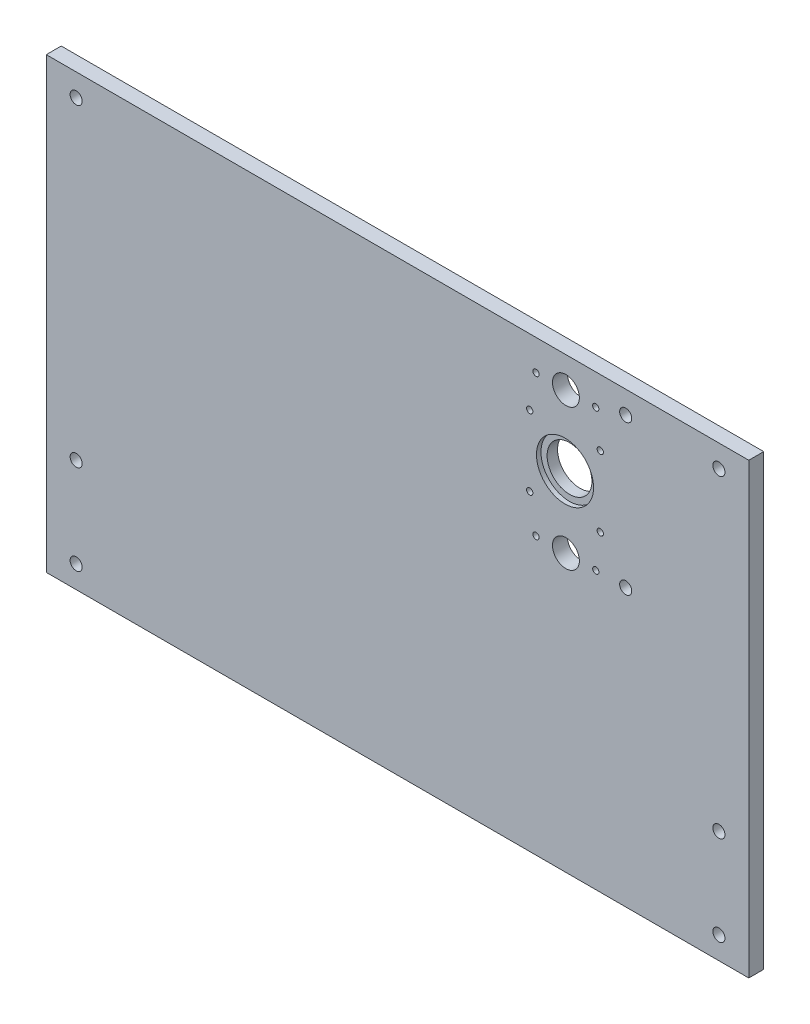
ISO-10303-21;
HEADER;
FILE_DESCRIPTION(('STEP AP214'),'2;1');
FILE_NAME('part.step','',(''),(''),'','','');
FILE_SCHEMA(('AUTOMOTIVE_DESIGN { 1 0 10303 214 1 1 1 1 }'));
ENDSEC;
DATA;
#1=APPLICATION_CONTEXT('core data for automotive mechanical design processes');
#2=APPLICATION_PROTOCOL_DEFINITION('international standard','automotive_design',2000,#1);
#3=PRODUCT_CONTEXT('',#1,'mechanical');
#4=PRODUCT('Part','Part','',(#3));
#5=PRODUCT_RELATED_PRODUCT_CATEGORY('part','',(#4));
#6=PRODUCT_DEFINITION_FORMATION('','',#4);
#7=PRODUCT_DEFINITION_CONTEXT('part definition',#1,'design');
#8=PRODUCT_DEFINITION('design','',#6,#7);
#9=PRODUCT_DEFINITION_SHAPE('','',#8);
#10=(LENGTH_UNIT() NAMED_UNIT(*) SI_UNIT(.MILLI.,.METRE.));
#11=(NAMED_UNIT(*) PLANE_ANGLE_UNIT() SI_UNIT($,.RADIAN.));
#12=(NAMED_UNIT(*) SI_UNIT($,.STERADIAN.) SOLID_ANGLE_UNIT());
#13=UNCERTAINTY_MEASURE_WITH_UNIT(LENGTH_MEASURE(1.E-05),#10,'distance_accuracy_value','');
#14=(GEOMETRIC_REPRESENTATION_CONTEXT(3) GLOBAL_UNCERTAINTY_ASSIGNED_CONTEXT((#13)) GLOBAL_UNIT_ASSIGNED_CONTEXT((#10,
#11,#12)) REPRESENTATION_CONTEXT('',''));
#15=CARTESIAN_POINT('',(0.,0.,0.));
#16=DIRECTION('',(0.,0.,1.));
#17=DIRECTION('',(1.,0.,0.));
#18=AXIS2_PLACEMENT_3D('',#15,#16,#17);
#19=CARTESIAN_POINT('',(235.,-150.,5.));
#20=DIRECTION('',(-1.,0.,0.));
#21=DIRECTION('',(0.,0.,1.));
#22=AXIS2_PLACEMENT_3D('',#19,#20,#21);
#23=PLANE('',#22);
#24=DIRECTION('',(0.,1.,0.));
#25=VECTOR('',#24,1.);
#26=CARTESIAN_POINT('',(235.,-150.,-5.));
#27=LINE('',#26,#25);
#28=CARTESIAN_POINT('',(235.,-150.,-5.));
#29=VERTEX_POINT('',#28);
#30=CARTESIAN_POINT('',(235.,150.,-5.));
#31=VERTEX_POINT('',#30);
#32=EDGE_CURVE('E100',#29,#31,#27,.T.);
#33=ORIENTED_EDGE('',*,*,#32,.T.);
#34=DIRECTION('',(0.,0.,-1.));
#35=VECTOR('',#34,1.);
#36=CARTESIAN_POINT('',(235.,150.,5.));
#37=LINE('',#36,#35);
#38=CARTESIAN_POINT('',(235.,150.,5.));
#39=VERTEX_POINT('',#38);
#40=EDGE_CURVE('E11',#39,#31,#37,.T.);
#41=ORIENTED_EDGE('',*,*,#40,.F.);
#42=DIRECTION('',(0.,1.,0.));
#43=VECTOR('',#42,1.);
#44=CARTESIAN_POINT('',(235.,-150.,5.));
#45=LINE('',#44,#43);
#46=CARTESIAN_POINT('',(235.,-150.,5.));
#47=VERTEX_POINT('',#46);
#48=EDGE_CURVE('E88',#47,#39,#45,.T.);
#49=ORIENTED_EDGE('',*,*,#48,.F.);
#50=DIRECTION('',(0.,0.,-1.));
#51=VECTOR('',#50,1.);
#52=CARTESIAN_POINT('',(235.,-150.,5.));
#53=LINE('',#52,#51);
#54=EDGE_CURVE('E96',#47,#29,#53,.T.);
#55=ORIENTED_EDGE('',*,*,#54,.T.);
#56=EDGE_LOOP('',(#33,#41,#49,#55));
#57=FACE_BOUND('',#56,.T.);
#58=ADVANCED_FACE('F37',(#57),#23,.F.);
#59=CARTESIAN_POINT('',(-235.,150.,5.));
#60=DIRECTION('',(0.,-1.,0.));
#61=DIRECTION('',(0.,0.,-1.));
#62=AXIS2_PLACEMENT_3D('',#59,#60,#61);
#63=PLANE('',#62);
#64=DIRECTION('',(-1.,0.,0.));
#65=VECTOR('',#64,1.);
#66=CARTESIAN_POINT('',(-235.,150.,-5.));
#67=LINE('',#66,#65);
#68=CARTESIAN_POINT('',(-235.,150.,-5.));
#69=VERTEX_POINT('',#68);
#70=EDGE_CURVE('E92',#31,#69,#67,.T.);
#71=ORIENTED_EDGE('',*,*,#70,.T.);
#72=DIRECTION('',(0.,0.,-1.));
#73=VECTOR('',#72,1.);
#74=CARTESIAN_POINT('',(-235.,150.,5.));
#75=LINE('',#74,#73);
#76=CARTESIAN_POINT('',(-235.,150.,5.));
#77=VERTEX_POINT('',#76);
#78=EDGE_CURVE('E45',#77,#69,#75,.T.);
#79=ORIENTED_EDGE('',*,*,#78,.F.);
#80=DIRECTION('',(-1.,0.,0.));
#81=VECTOR('',#80,1.);
#82=CARTESIAN_POINT('',(-235.,150.,5.));
#83=LINE('',#82,#81);
#84=EDGE_CURVE('E83',#39,#77,#83,.T.);
#85=ORIENTED_EDGE('',*,*,#84,.F.);
#86=ORIENTED_EDGE('',*,*,#40,.T.);
#87=EDGE_LOOP('',(#71,#79,#85,#86));
#88=FACE_BOUND('',#87,.T.);
#89=ADVANCED_FACE('F91',(#88),#63,.F.);
#90=CARTESIAN_POINT('',(-235.,-150.,5.));
#91=DIRECTION('',(1.,0.,0.));
#92=DIRECTION('',(0.,0.,-1.));
#93=AXIS2_PLACEMENT_3D('',#90,#91,#92);
#94=PLANE('',#93);
#95=DIRECTION('',(0.,-1.,0.));
#96=VECTOR('',#95,1.);
#97=CARTESIAN_POINT('',(-235.,-150.,-5.));
#98=LINE('',#97,#96);
#99=CARTESIAN_POINT('',(-235.,-150.,-5.));
#100=VERTEX_POINT('',#99);
#101=EDGE_CURVE('E70',#69,#100,#98,.T.);
#102=ORIENTED_EDGE('',*,*,#101,.T.);
#103=DIRECTION('',(0.,0.,-1.));
#104=VECTOR('',#103,1.);
#105=CARTESIAN_POINT('',(-235.,-150.,5.));
#106=LINE('',#105,#104);
#107=CARTESIAN_POINT('',(-235.,-150.,5.));
#108=VERTEX_POINT('',#107);
#109=EDGE_CURVE('E93',#108,#100,#106,.T.);
#110=ORIENTED_EDGE('',*,*,#109,.F.);
#111=DIRECTION('',(0.,-1.,0.));
#112=VECTOR('',#111,1.);
#113=CARTESIAN_POINT('',(-235.,-150.,5.));
#114=LINE('',#113,#112);
#115=EDGE_CURVE('E86',#77,#108,#114,.T.);
#116=ORIENTED_EDGE('',*,*,#115,.F.);
#117=ORIENTED_EDGE('',*,*,#78,.T.);
#118=EDGE_LOOP('',(#102,#110,#116,#117));
#119=FACE_BOUND('',#118,.T.);
#120=ADVANCED_FACE('F94',(#119),#94,.F.);
#121=CARTESIAN_POINT('',(-235.,-150.,5.));
#122=DIRECTION('',(0.,1.,0.));
#123=DIRECTION('',(0.,0.,1.));
#124=AXIS2_PLACEMENT_3D('',#121,#122,#123);
#125=PLANE('',#124);
#126=DIRECTION('',(1.,0.,0.));
#127=VECTOR('',#126,1.);
#128=CARTESIAN_POINT('',(-235.,-150.,-5.));
#129=LINE('',#128,#127);
#130=EDGE_CURVE('E76',#100,#29,#129,.T.);
#131=ORIENTED_EDGE('',*,*,#130,.T.);
#132=ORIENTED_EDGE('',*,*,#54,.F.);
#133=DIRECTION('',(1.,0.,0.));
#134=VECTOR('',#133,1.);
#135=CARTESIAN_POINT('',(-235.,-150.,5.));
#136=LINE('',#135,#134);
#137=EDGE_CURVE('E53',#108,#47,#136,.T.);
#138=ORIENTED_EDGE('',*,*,#137,.F.);
#139=ORIENTED_EDGE('',*,*,#109,.T.);
#140=EDGE_LOOP('',(#131,#132,#138,#139));
#141=FACE_BOUND('',#140,.T.);
#142=ADVANCED_FACE('F108',(#141),#125,.F.);
#143=CARTESIAN_POINT('',(0.,0.,5.));
#144=DIRECTION('',(0.,0.,-1.));
#145=DIRECTION('',(-1.,0.,0.));
#146=AXIS2_PLACEMENT_3D('',#143,#144,#145);
#147=PLANE('',#146);
#148=CARTESIAN_POINT('',(88.4499999999999,58.65,5.));
#149=DIRECTION('',(0.,0.,1.));
#150=DIRECTION('',(1.,0.,0.));
#151=AXIS2_PLACEMENT_3D('',#148,#149,#150);
#152=CIRCLE('',#151,2.1);
#153=CARTESIAN_POINT('',(90.5499999999999,58.65,5.));
#154=VERTEX_POINT('',#153);
#155=EDGE_CURVE('E228',#154,#154,#152,.T.);
#156=ORIENTED_EDGE('',*,*,#155,.F.);
#157=EDGE_LOOP('',(#156));
#158=FACE_BOUND('',#157,.T.);
#159=CARTESIAN_POINT('',(135.65,58.65,5.));
#160=DIRECTION('',(0.,0.,1.));
#161=DIRECTION('',(1.,0.,0.));
#162=AXIS2_PLACEMENT_3D('',#159,#160,#161);
#163=CIRCLE('',#162,2.09999999999999);
#164=CARTESIAN_POINT('',(137.75,58.65,5.));
#165=VERTEX_POINT('',#164);
#166=EDGE_CURVE('E222',#165,#165,#163,.T.);
#167=ORIENTED_EDGE('',*,*,#166,.F.);
#168=EDGE_LOOP('',(#167));
#169=FACE_BOUND('',#168,.T.);
#170=CARTESIAN_POINT('',(135.65,105.85,5.));
#171=DIRECTION('',(0.,0.,1.));
#172=DIRECTION('',(1.,0.,0.));
#173=AXIS2_PLACEMENT_3D('',#170,#171,#172);
#174=CIRCLE('',#173,2.09999999999999);
#175=CARTESIAN_POINT('',(137.75,105.85,5.));
#176=VERTEX_POINT('',#175);
#177=EDGE_CURVE('E216',#176,#176,#174,.T.);
#178=ORIENTED_EDGE('',*,*,#177,.F.);
#179=EDGE_LOOP('',(#178));
#180=FACE_BOUND('',#179,.T.);
#181=CARTESIAN_POINT('',(88.4499999999999,105.85,5.));
#182=DIRECTION('',(0.,0.,1.));
#183=DIRECTION('',(1.,0.,0.));
#184=AXIS2_PLACEMENT_3D('',#181,#182,#183);
#185=CIRCLE('',#184,2.1);
#186=CARTESIAN_POINT('',(90.5499999999999,105.85,5.));
#187=VERTEX_POINT('',#186);
#188=EDGE_CURVE('E210',#187,#187,#185,.T.);
#189=ORIENTED_EDGE('',*,*,#188,.F.);
#190=EDGE_LOOP('',(#189));
#191=FACE_BOUND('',#190,.T.);
#192=CARTESIAN_POINT('',(112.05,82.25,5.));
#193=DIRECTION('',(0.,0.,1.));
#194=DIRECTION('',(1.,0.,0.));
#195=AXIS2_PLACEMENT_3D('',#192,#193,#194);
#196=CIRCLE('',#195,19.1);
#197=CARTESIAN_POINT('',(131.15,82.25,5.));
#198=VERTEX_POINT('',#197);
#199=EDGE_CURVE('E198',#198,#198,#196,.T.);
#200=ORIENTED_EDGE('',*,*,#199,.F.);
#201=EDGE_LOOP('',(#200));
#202=FACE_BOUND('',#201,.T.);
#203=CARTESIAN_POINT('',(152.65,35.,5.));
#204=DIRECTION('',(0.,0.,1.));
#205=DIRECTION('',(1.,0.,0.));
#206=AXIS2_PLACEMENT_3D('',#203,#204,#205);
#207=CIRCLE('',#206,4.04999999999999);
#208=CARTESIAN_POINT('',(156.7,35.,5.));
#209=VERTEX_POINT('',#208);
#210=EDGE_CURVE('E192',#209,#209,#207,.T.);
#211=ORIENTED_EDGE('',*,*,#210,.F.);
#212=EDGE_LOOP('',(#211));
#213=FACE_BOUND('',#212,.T.);
#214=CARTESIAN_POINT('',(152.65,135.,5.));
#215=DIRECTION('',(0.,0.,1.));
#216=DIRECTION('',(1.,0.,0.));
#217=AXIS2_PLACEMENT_3D('',#214,#215,#216);
#218=CIRCLE('',#217,4.04999999999999);
#219=CARTESIAN_POINT('',(156.7,135.,5.));
#220=VERTEX_POINT('',#219);
#221=EDGE_CURVE('E186',#220,#220,#218,.T.);
#222=ORIENTED_EDGE('',*,*,#221,.F.);
#223=EDGE_LOOP('',(#222));
#224=FACE_BOUND('',#223,.T.);
#225=CARTESIAN_POINT('',(92.6499999999999,35.,5.));
#226=DIRECTION('',(0.,0.,1.));
#227=DIRECTION('',(1.,0.,0.));
#228=AXIS2_PLACEMENT_3D('',#225,#226,#227);
#229=CIRCLE('',#228,2.1);
#230=CARTESIAN_POINT('',(94.7499999999999,35.,5.));
#231=VERTEX_POINT('',#230);
#232=EDGE_CURVE('E180',#231,#231,#229,.T.);
#233=ORIENTED_EDGE('',*,*,#232,.F.);
#234=EDGE_LOOP('',(#233));
#235=FACE_BOUND('',#234,.T.);
#236=CARTESIAN_POINT('',(132.65,35.,5.));
#237=DIRECTION('',(0.,0.,1.));
#238=DIRECTION('',(1.,0.,0.));
#239=AXIS2_PLACEMENT_3D('',#236,#237,#238);
#240=CIRCLE('',#239,2.09999999999999);
#241=CARTESIAN_POINT('',(134.75,35.,5.));
#242=VERTEX_POINT('',#241);
#243=EDGE_CURVE('E174',#242,#242,#240,.T.);
#244=ORIENTED_EDGE('',*,*,#243,.F.);
#245=EDGE_LOOP('',(#244));
#246=FACE_BOUND('',#245,.T.);
#247=CARTESIAN_POINT('',(132.65,129.5,5.));
#248=DIRECTION('',(0.,0.,1.));
#249=DIRECTION('',(1.,0.,0.));
#250=AXIS2_PLACEMENT_3D('',#247,#248,#249);
#251=CIRCLE('',#250,2.09999999999999);
#252=CARTESIAN_POINT('',(134.75,129.5,5.));
#253=VERTEX_POINT('',#252);
#254=EDGE_CURVE('E168',#253,#253,#251,.T.);
#255=ORIENTED_EDGE('',*,*,#254,.F.);
#256=EDGE_LOOP('',(#255));
#257=FACE_BOUND('',#256,.T.);
#258=CARTESIAN_POINT('',(92.6499999999999,129.5,5.));
#259=DIRECTION('',(0.,0.,1.));
#260=DIRECTION('',(1.,0.,0.));
#261=AXIS2_PLACEMENT_3D('',#258,#259,#260);
#262=CIRCLE('',#261,2.1);
#263=CARTESIAN_POINT('',(94.7499999999999,129.5,5.));
#264=VERTEX_POINT('',#263);
#265=EDGE_CURVE('E162',#264,#264,#262,.T.);
#266=ORIENTED_EDGE('',*,*,#265,.F.);
#267=EDGE_LOOP('',(#266));
#268=FACE_BOUND('',#267,.T.);
#269=CARTESIAN_POINT('',(112.65,35.,5.));
#270=DIRECTION('',(0.,0.,1.));
#271=DIRECTION('',(1.,0.,0.));
#272=AXIS2_PLACEMENT_3D('',#269,#270,#271);
#273=CIRCLE('',#272,9.);
#274=CARTESIAN_POINT('',(121.65,35.,5.));
#275=VERTEX_POINT('',#274);
#276=EDGE_CURVE('E156',#275,#275,#273,.T.);
#277=ORIENTED_EDGE('',*,*,#276,.F.);
#278=EDGE_LOOP('',(#277));
#279=FACE_BOUND('',#278,.T.);
#280=CARTESIAN_POINT('',(112.65,129.5,5.));
#281=DIRECTION('',(0.,0.,1.));
#282=DIRECTION('',(1.,0.,0.));
#283=AXIS2_PLACEMENT_3D('',#280,#281,#282);
#284=CIRCLE('',#283,9.);
#285=CARTESIAN_POINT('',(121.65,129.5,5.));
#286=VERTEX_POINT('',#285);
#287=EDGE_CURVE('E150',#286,#286,#284,.T.);
#288=ORIENTED_EDGE('',*,*,#287,.F.);
#289=EDGE_LOOP('',(#288));
#290=FACE_BOUND('',#289,.T.);
#291=CARTESIAN_POINT('',(215.000000000002,134.999999999995,5.));
#292=DIRECTION('',(0.,0.,1.));
#293=DIRECTION('',(1.,0.,0.));
#294=AXIS2_PLACEMENT_3D('',#291,#292,#293);
#295=CIRCLE('',#294,4.04999999999999);
#296=CARTESIAN_POINT('',(219.050000000002,134.999999999995,5.));
#297=VERTEX_POINT('',#296);
#298=EDGE_CURVE('E144',#297,#297,#295,.T.);
#299=ORIENTED_EDGE('',*,*,#298,.F.);
#300=EDGE_LOOP('',(#299));
#301=FACE_BOUND('',#300,.T.);
#302=CARTESIAN_POINT('',(-215.,135.,5.));
#303=DIRECTION('',(0.,0.,1.));
#304=DIRECTION('',(1.,0.,0.));
#305=AXIS2_PLACEMENT_3D('',#302,#303,#304);
#306=CIRCLE('',#305,4.04999999999999);
#307=CARTESIAN_POINT('',(-210.95,135.,5.));
#308=VERTEX_POINT('',#307);
#309=EDGE_CURVE('E138',#308,#308,#306,.T.);
#310=ORIENTED_EDGE('',*,*,#309,.F.);
#311=EDGE_LOOP('',(#310));
#312=FACE_BOUND('',#311,.T.);
#313=CARTESIAN_POINT('',(215.000000000002,-134.999999999995,5.));
#314=DIRECTION('',(0.,0.,1.));
#315=DIRECTION('',(1.,0.,0.));
#316=AXIS2_PLACEMENT_3D('',#313,#314,#315);
#317=CIRCLE('',#316,4.04999999999999);
#318=CARTESIAN_POINT('',(219.050000000002,-134.999999999995,5.));
#319=VERTEX_POINT('',#318);
#320=EDGE_CURVE('E132',#319,#319,#317,.T.);
#321=ORIENTED_EDGE('',*,*,#320,.F.);
#322=EDGE_LOOP('',(#321));
#323=FACE_BOUND('',#322,.T.);
#324=CARTESIAN_POINT('',(215.000000000002,-74.9999999999943,5.));
#325=DIRECTION('',(0.,0.,1.));
#326=DIRECTION('',(1.,0.,0.));
#327=AXIS2_PLACEMENT_3D('',#324,#325,#326);
#328=CIRCLE('',#327,4.04999999999999);
#329=CARTESIAN_POINT('',(219.050000000002,-74.9999999999943,5.));
#330=VERTEX_POINT('',#329);
#331=EDGE_CURVE('E126',#330,#330,#328,.T.);
#332=ORIENTED_EDGE('',*,*,#331,.F.);
#333=EDGE_LOOP('',(#332));
#334=FACE_BOUND('',#333,.T.);
#335=CARTESIAN_POINT('',(-215.000000000002,-134.999999999995,5.));
#336=DIRECTION('',(0.,0.,1.));
#337=DIRECTION('',(1.,0.,0.));
#338=AXIS2_PLACEMENT_3D('',#335,#336,#337);
#339=CIRCLE('',#338,4.04999999999999);
#340=CARTESIAN_POINT('',(-210.950000000002,-134.999999999995,5.));
#341=VERTEX_POINT('',#340);
#342=EDGE_CURVE('E120',#341,#341,#339,.T.);
#343=ORIENTED_EDGE('',*,*,#342,.F.);
#344=EDGE_LOOP('',(#343));
#345=FACE_BOUND('',#344,.T.);
#346=CARTESIAN_POINT('',(-215.000000000002,-74.9999999999943,5.));
#347=DIRECTION('',(0.,0.,1.));
#348=DIRECTION('',(1.,0.,0.));
#349=AXIS2_PLACEMENT_3D('',#346,#347,#348);
#350=CIRCLE('',#349,4.04999999999999);
#351=CARTESIAN_POINT('',(-210.950000000002,-74.9999999999943,5.));
#352=VERTEX_POINT('',#351);
#353=EDGE_CURVE('E114',#352,#352,#350,.T.);
#354=ORIENTED_EDGE('',*,*,#353,.F.);
#355=EDGE_LOOP('',(#354));
#356=FACE_BOUND('',#355,.T.);
#357=ORIENTED_EDGE('',*,*,#48,.T.);
#358=ORIENTED_EDGE('',*,*,#84,.T.);
#359=ORIENTED_EDGE('',*,*,#115,.T.);
#360=ORIENTED_EDGE('',*,*,#137,.T.);
#361=EDGE_LOOP('',(#357,#358,#359,#360));
#362=FACE_BOUND('',#361,.T.);
#363=ADVANCED_FACE('F84',(#158,#169,#180,#191,#202,#213,#224,#235,#246,#257,#268,#279,#290,#301,
#312,#323,#334,#345,#356,#362),#147,.F.);
#364=CARTESIAN_POINT('',(0.,0.,-5.));
#365=DIRECTION('',(0.,0.,-1.));
#366=DIRECTION('',(-1.,0.,0.));
#367=AXIS2_PLACEMENT_3D('',#364,#365,#366);
#368=PLANE('',#367);
#369=CARTESIAN_POINT('',(88.4499999999999,58.65,-5.));
#370=DIRECTION('',(0.,0.,1.));
#371=DIRECTION('',(1.,0.,0.));
#372=AXIS2_PLACEMENT_3D('',#369,#370,#371);
#373=CIRCLE('',#372,2.1);
#374=CARTESIAN_POINT('',(90.5499999999999,58.65,-5.));
#375=VERTEX_POINT('',#374);
#376=EDGE_CURVE('E225',#375,#375,#373,.T.);
#377=ORIENTED_EDGE('',*,*,#376,.T.);
#378=EDGE_LOOP('',(#377));
#379=FACE_BOUND('',#378,.T.);
#380=CARTESIAN_POINT('',(135.65,58.65,-5.));
#381=DIRECTION('',(0.,0.,1.));
#382=DIRECTION('',(1.,0.,0.));
#383=AXIS2_PLACEMENT_3D('',#380,#381,#382);
#384=CIRCLE('',#383,2.09999999999999);
#385=CARTESIAN_POINT('',(137.75,58.65,-5.));
#386=VERTEX_POINT('',#385);
#387=EDGE_CURVE('E219',#386,#386,#384,.T.);
#388=ORIENTED_EDGE('',*,*,#387,.T.);
#389=EDGE_LOOP('',(#388));
#390=FACE_BOUND('',#389,.T.);
#391=CARTESIAN_POINT('',(135.65,105.85,-5.));
#392=DIRECTION('',(0.,0.,1.));
#393=DIRECTION('',(1.,0.,0.));
#394=AXIS2_PLACEMENT_3D('',#391,#392,#393);
#395=CIRCLE('',#394,2.09999999999999);
#396=CARTESIAN_POINT('',(137.75,105.85,-5.));
#397=VERTEX_POINT('',#396);
#398=EDGE_CURVE('E213',#397,#397,#395,.T.);
#399=ORIENTED_EDGE('',*,*,#398,.T.);
#400=EDGE_LOOP('',(#399));
#401=FACE_BOUND('',#400,.T.);
#402=CARTESIAN_POINT('',(88.4499999999999,105.85,-5.));
#403=DIRECTION('',(0.,0.,1.));
#404=DIRECTION('',(1.,0.,0.));
#405=AXIS2_PLACEMENT_3D('',#402,#403,#404);
#406=CIRCLE('',#405,2.1);
#407=CARTESIAN_POINT('',(90.5499999999999,105.85,-5.));
#408=VERTEX_POINT('',#407);
#409=EDGE_CURVE('E207',#408,#408,#406,.T.);
#410=ORIENTED_EDGE('',*,*,#409,.T.);
#411=EDGE_LOOP('',(#410));
#412=FACE_BOUND('',#411,.T.);
#413=CARTESIAN_POINT('',(112.05,82.25,-5.));
#414=DIRECTION('',(0.,0.,1.));
#415=DIRECTION('',(1.,0.,0.));
#416=AXIS2_PLACEMENT_3D('',#413,#414,#415);
#417=CIRCLE('',#416,15.);
#418=CARTESIAN_POINT('',(127.05,82.25,-5.));
#419=VERTEX_POINT('',#418);
#420=EDGE_CURVE('E201',#419,#419,#417,.T.);
#421=ORIENTED_EDGE('',*,*,#420,.T.);
#422=EDGE_LOOP('',(#421));
#423=FACE_BOUND('',#422,.T.);
#424=CARTESIAN_POINT('',(152.65,35.,-5.));
#425=DIRECTION('',(0.,0.,1.));
#426=DIRECTION('',(1.,0.,0.));
#427=AXIS2_PLACEMENT_3D('',#424,#425,#426);
#428=CIRCLE('',#427,4.04999999999999);
#429=CARTESIAN_POINT('',(156.7,35.,-5.));
#430=VERTEX_POINT('',#429);
#431=EDGE_CURVE('E189',#430,#430,#428,.T.);
#432=ORIENTED_EDGE('',*,*,#431,.T.);
#433=EDGE_LOOP('',(#432));
#434=FACE_BOUND('',#433,.T.);
#435=CARTESIAN_POINT('',(152.65,135.,-5.));
#436=DIRECTION('',(0.,0.,1.));
#437=DIRECTION('',(1.,0.,0.));
#438=AXIS2_PLACEMENT_3D('',#435,#436,#437);
#439=CIRCLE('',#438,4.04999999999999);
#440=CARTESIAN_POINT('',(156.7,135.,-5.));
#441=VERTEX_POINT('',#440);
#442=EDGE_CURVE('E183',#441,#441,#439,.T.);
#443=ORIENTED_EDGE('',*,*,#442,.T.);
#444=EDGE_LOOP('',(#443));
#445=FACE_BOUND('',#444,.T.);
#446=CARTESIAN_POINT('',(92.6499999999999,35.,-5.));
#447=DIRECTION('',(0.,0.,1.));
#448=DIRECTION('',(1.,0.,0.));
#449=AXIS2_PLACEMENT_3D('',#446,#447,#448);
#450=CIRCLE('',#449,2.1);
#451=CARTESIAN_POINT('',(94.7499999999999,35.,-5.));
#452=VERTEX_POINT('',#451);
#453=EDGE_CURVE('E177',#452,#452,#450,.T.);
#454=ORIENTED_EDGE('',*,*,#453,.T.);
#455=EDGE_LOOP('',(#454));
#456=FACE_BOUND('',#455,.T.);
#457=CARTESIAN_POINT('',(132.65,35.,-5.));
#458=DIRECTION('',(0.,0.,1.));
#459=DIRECTION('',(1.,0.,0.));
#460=AXIS2_PLACEMENT_3D('',#457,#458,#459);
#461=CIRCLE('',#460,2.09999999999999);
#462=CARTESIAN_POINT('',(134.75,35.,-5.));
#463=VERTEX_POINT('',#462);
#464=EDGE_CURVE('E171',#463,#463,#461,.T.);
#465=ORIENTED_EDGE('',*,*,#464,.T.);
#466=EDGE_LOOP('',(#465));
#467=FACE_BOUND('',#466,.T.);
#468=CARTESIAN_POINT('',(132.65,129.5,-5.));
#469=DIRECTION('',(0.,0.,1.));
#470=DIRECTION('',(1.,0.,0.));
#471=AXIS2_PLACEMENT_3D('',#468,#469,#470);
#472=CIRCLE('',#471,2.09999999999999);
#473=CARTESIAN_POINT('',(134.75,129.5,-5.));
#474=VERTEX_POINT('',#473);
#475=EDGE_CURVE('E165',#474,#474,#472,.T.);
#476=ORIENTED_EDGE('',*,*,#475,.T.);
#477=EDGE_LOOP('',(#476));
#478=FACE_BOUND('',#477,.T.);
#479=CARTESIAN_POINT('',(92.6499999999999,129.5,-5.));
#480=DIRECTION('',(0.,0.,1.));
#481=DIRECTION('',(1.,0.,0.));
#482=AXIS2_PLACEMENT_3D('',#479,#480,#481);
#483=CIRCLE('',#482,2.1);
#484=CARTESIAN_POINT('',(94.7499999999999,129.5,-5.));
#485=VERTEX_POINT('',#484);
#486=EDGE_CURVE('E159',#485,#485,#483,.T.);
#487=ORIENTED_EDGE('',*,*,#486,.T.);
#488=EDGE_LOOP('',(#487));
#489=FACE_BOUND('',#488,.T.);
#490=CARTESIAN_POINT('',(112.65,35.,-5.));
#491=DIRECTION('',(0.,0.,1.));
#492=DIRECTION('',(1.,0.,0.));
#493=AXIS2_PLACEMENT_3D('',#490,#491,#492);
#494=CIRCLE('',#493,9.);
#495=CARTESIAN_POINT('',(121.65,35.,-5.));
#496=VERTEX_POINT('',#495);
#497=EDGE_CURVE('E153',#496,#496,#494,.T.);
#498=ORIENTED_EDGE('',*,*,#497,.T.);
#499=EDGE_LOOP('',(#498));
#500=FACE_BOUND('',#499,.T.);
#501=CARTESIAN_POINT('',(112.65,129.5,-5.));
#502=DIRECTION('',(0.,0.,1.));
#503=DIRECTION('',(1.,0.,0.));
#504=AXIS2_PLACEMENT_3D('',#501,#502,#503);
#505=CIRCLE('',#504,9.);
#506=CARTESIAN_POINT('',(121.65,129.5,-5.));
#507=VERTEX_POINT('',#506);
#508=EDGE_CURVE('E147',#507,#507,#505,.T.);
#509=ORIENTED_EDGE('',*,*,#508,.T.);
#510=EDGE_LOOP('',(#509));
#511=FACE_BOUND('',#510,.T.);
#512=CARTESIAN_POINT('',(215.000000000002,134.999999999995,-5.));
#513=DIRECTION('',(0.,0.,1.));
#514=DIRECTION('',(1.,0.,0.));
#515=AXIS2_PLACEMENT_3D('',#512,#513,#514);
#516=CIRCLE('',#515,4.04999999999999);
#517=CARTESIAN_POINT('',(219.050000000002,134.999999999995,-5.));
#518=VERTEX_POINT('',#517);
#519=EDGE_CURVE('E141',#518,#518,#516,.T.);
#520=ORIENTED_EDGE('',*,*,#519,.T.);
#521=EDGE_LOOP('',(#520));
#522=FACE_BOUND('',#521,.T.);
#523=CARTESIAN_POINT('',(-215.,135.,-5.));
#524=DIRECTION('',(0.,0.,1.));
#525=DIRECTION('',(1.,0.,0.));
#526=AXIS2_PLACEMENT_3D('',#523,#524,#525);
#527=CIRCLE('',#526,4.04999999999999);
#528=CARTESIAN_POINT('',(-210.95,135.,-5.));
#529=VERTEX_POINT('',#528);
#530=EDGE_CURVE('E135',#529,#529,#527,.T.);
#531=ORIENTED_EDGE('',*,*,#530,.T.);
#532=EDGE_LOOP('',(#531));
#533=FACE_BOUND('',#532,.T.);
#534=CARTESIAN_POINT('',(215.000000000002,-134.999999999995,-5.));
#535=DIRECTION('',(0.,0.,1.));
#536=DIRECTION('',(1.,0.,0.));
#537=AXIS2_PLACEMENT_3D('',#534,#535,#536);
#538=CIRCLE('',#537,4.04999999999999);
#539=CARTESIAN_POINT('',(219.050000000002,-134.999999999995,-5.));
#540=VERTEX_POINT('',#539);
#541=EDGE_CURVE('E129',#540,#540,#538,.T.);
#542=ORIENTED_EDGE('',*,*,#541,.T.);
#543=EDGE_LOOP('',(#542));
#544=FACE_BOUND('',#543,.T.);
#545=CARTESIAN_POINT('',(215.000000000002,-74.9999999999943,-5.));
#546=DIRECTION('',(0.,0.,1.));
#547=DIRECTION('',(1.,0.,0.));
#548=AXIS2_PLACEMENT_3D('',#545,#546,#547);
#549=CIRCLE('',#548,4.04999999999999);
#550=CARTESIAN_POINT('',(219.050000000002,-74.9999999999943,-5.));
#551=VERTEX_POINT('',#550);
#552=EDGE_CURVE('E123',#551,#551,#549,.T.);
#553=ORIENTED_EDGE('',*,*,#552,.T.);
#554=EDGE_LOOP('',(#553));
#555=FACE_BOUND('',#554,.T.);
#556=CARTESIAN_POINT('',(-215.000000000002,-134.999999999995,-5.));
#557=DIRECTION('',(0.,0.,1.));
#558=DIRECTION('',(1.,0.,0.));
#559=AXIS2_PLACEMENT_3D('',#556,#557,#558);
#560=CIRCLE('',#559,4.04999999999999);
#561=CARTESIAN_POINT('',(-210.950000000002,-134.999999999995,-5.));
#562=VERTEX_POINT('',#561);
#563=EDGE_CURVE('E117',#562,#562,#560,.T.);
#564=ORIENTED_EDGE('',*,*,#563,.T.);
#565=EDGE_LOOP('',(#564));
#566=FACE_BOUND('',#565,.T.);
#567=CARTESIAN_POINT('',(-215.000000000002,-74.9999999999943,-5.));
#568=DIRECTION('',(0.,0.,1.));
#569=DIRECTION('',(1.,0.,0.));
#570=AXIS2_PLACEMENT_3D('',#567,#568,#569);
#571=CIRCLE('',#570,4.04999999999999);
#572=CARTESIAN_POINT('',(-210.950000000002,-74.9999999999943,-5.));
#573=VERTEX_POINT('',#572);
#574=EDGE_CURVE('E103',#573,#573,#571,.T.);
#575=ORIENTED_EDGE('',*,*,#574,.T.);
#576=EDGE_LOOP('',(#575));
#577=FACE_BOUND('',#576,.T.);
#578=ORIENTED_EDGE('',*,*,#32,.F.);
#579=ORIENTED_EDGE('',*,*,#130,.F.);
#580=ORIENTED_EDGE('',*,*,#101,.F.);
#581=ORIENTED_EDGE('',*,*,#70,.F.);
#582=EDGE_LOOP('',(#578,#579,#580,#581));
#583=FACE_BOUND('',#582,.T.);
#584=ADVANCED_FACE('F111',(#379,#390,#401,#412,#423,#434,#445,#456,#467,#478,#489,#500,#511,
#522,#533,#544,#555,#566,#577,#583),#368,.T.);
#585=CARTESIAN_POINT('',(-215.000000000002,-74.9999999999943,-5.));
#586=DIRECTION('',(0.,0.,1.));
#587=DIRECTION('',(1.,0.,0.));
#588=AXIS2_PLACEMENT_3D('',#585,#586,#587);
#589=CYLINDRICAL_SURFACE('',#588,4.04999999999999);
#590=ORIENTED_EDGE('',*,*,#574,.F.);
#591=EDGE_LOOP('',(#590));
#592=FACE_BOUND('',#591,.T.);
#593=ORIENTED_EDGE('',*,*,#353,.T.);
#594=EDGE_LOOP('',(#593));
#595=FACE_BOUND('',#594,.T.);
#596=ADVANCED_FACE('F282',(#592,#595),#589,.F.);
#597=CARTESIAN_POINT('',(-215.000000000002,-134.999999999995,-5.));
#598=DIRECTION('',(0.,0.,1.));
#599=DIRECTION('',(1.,0.,0.));
#600=AXIS2_PLACEMENT_3D('',#597,#598,#599);
#601=CYLINDRICAL_SURFACE('',#600,4.04999999999999);
#602=ORIENTED_EDGE('',*,*,#563,.F.);
#603=EDGE_LOOP('',(#602));
#604=FACE_BOUND('',#603,.T.);
#605=ORIENTED_EDGE('',*,*,#342,.T.);
#606=EDGE_LOOP('',(#605));
#607=FACE_BOUND('',#606,.T.);
#608=ADVANCED_FACE('F284',(#604,#607),#601,.F.);
#609=CARTESIAN_POINT('',(215.000000000002,-74.9999999999943,-5.));
#610=DIRECTION('',(0.,0.,1.));
#611=DIRECTION('',(1.,0.,0.));
#612=AXIS2_PLACEMENT_3D('',#609,#610,#611);
#613=CYLINDRICAL_SURFACE('',#612,4.04999999999999);
#614=ORIENTED_EDGE('',*,*,#552,.F.);
#615=EDGE_LOOP('',(#614));
#616=FACE_BOUND('',#615,.T.);
#617=ORIENTED_EDGE('',*,*,#331,.T.);
#618=EDGE_LOOP('',(#617));
#619=FACE_BOUND('',#618,.T.);
#620=ADVANCED_FACE('F291',(#616,#619),#613,.F.);
#621=CARTESIAN_POINT('',(215.000000000002,-134.999999999995,-5.));
#622=DIRECTION('',(0.,0.,1.));
#623=DIRECTION('',(1.,0.,0.));
#624=AXIS2_PLACEMENT_3D('',#621,#622,#623);
#625=CYLINDRICAL_SURFACE('',#624,4.04999999999999);
#626=ORIENTED_EDGE('',*,*,#541,.F.);
#627=EDGE_LOOP('',(#626));
#628=FACE_BOUND('',#627,.T.);
#629=ORIENTED_EDGE('',*,*,#320,.T.);
#630=EDGE_LOOP('',(#629));
#631=FACE_BOUND('',#630,.T.);
#632=ADVANCED_FACE('F415',(#628,#631),#625,.F.);
#633=CARTESIAN_POINT('',(-215.,135.,-5.));
#634=DIRECTION('',(0.,0.,1.));
#635=DIRECTION('',(1.,0.,0.));
#636=AXIS2_PLACEMENT_3D('',#633,#634,#635);
#637=CYLINDRICAL_SURFACE('',#636,4.04999999999999);
#638=ORIENTED_EDGE('',*,*,#530,.F.);
#639=EDGE_LOOP('',(#638));
#640=FACE_BOUND('',#639,.T.);
#641=ORIENTED_EDGE('',*,*,#309,.T.);
#642=EDGE_LOOP('',(#641));
#643=FACE_BOUND('',#642,.T.);
#644=ADVANCED_FACE('F411',(#640,#643),#637,.F.);
#645=CARTESIAN_POINT('',(215.000000000002,134.999999999995,-5.));
#646=DIRECTION('',(0.,0.,1.));
#647=DIRECTION('',(1.,0.,0.));
#648=AXIS2_PLACEMENT_3D('',#645,#646,#647);
#649=CYLINDRICAL_SURFACE('',#648,4.04999999999999);
#650=ORIENTED_EDGE('',*,*,#519,.F.);
#651=EDGE_LOOP('',(#650));
#652=FACE_BOUND('',#651,.T.);
#653=ORIENTED_EDGE('',*,*,#298,.T.);
#654=EDGE_LOOP('',(#653));
#655=FACE_BOUND('',#654,.T.);
#656=ADVANCED_FACE('F407',(#652,#655),#649,.F.);
#657=CARTESIAN_POINT('',(112.65,129.5,-5.));
#658=DIRECTION('',(0.,0.,1.));
#659=DIRECTION('',(1.,0.,0.));
#660=AXIS2_PLACEMENT_3D('',#657,#658,#659);
#661=CYLINDRICAL_SURFACE('',#660,9.);
#662=ORIENTED_EDGE('',*,*,#508,.F.);
#663=EDGE_LOOP('',(#662));
#664=FACE_BOUND('',#663,.T.);
#665=ORIENTED_EDGE('',*,*,#287,.T.);
#666=EDGE_LOOP('',(#665));
#667=FACE_BOUND('',#666,.T.);
#668=ADVANCED_FACE('F403',(#664,#667),#661,.F.);
#669=CARTESIAN_POINT('',(112.65,35.,-5.));
#670=DIRECTION('',(0.,0.,1.));
#671=DIRECTION('',(1.,0.,0.));
#672=AXIS2_PLACEMENT_3D('',#669,#670,#671);
#673=CYLINDRICAL_SURFACE('',#672,9.);
#674=ORIENTED_EDGE('',*,*,#497,.F.);
#675=EDGE_LOOP('',(#674));
#676=FACE_BOUND('',#675,.T.);
#677=ORIENTED_EDGE('',*,*,#276,.T.);
#678=EDGE_LOOP('',(#677));
#679=FACE_BOUND('',#678,.T.);
#680=ADVANCED_FACE('F399',(#676,#679),#673,.F.);
#681=CARTESIAN_POINT('',(92.6499999999999,129.5,-5.));
#682=DIRECTION('',(0.,0.,1.));
#683=DIRECTION('',(1.,0.,0.));
#684=AXIS2_PLACEMENT_3D('',#681,#682,#683);
#685=CYLINDRICAL_SURFACE('',#684,2.1);
#686=ORIENTED_EDGE('',*,*,#486,.F.);
#687=EDGE_LOOP('',(#686));
#688=FACE_BOUND('',#687,.T.);
#689=ORIENTED_EDGE('',*,*,#265,.T.);
#690=EDGE_LOOP('',(#689));
#691=FACE_BOUND('',#690,.T.);
#692=ADVANCED_FACE('F395',(#688,#691),#685,.F.);
#693=CARTESIAN_POINT('',(132.65,129.5,-5.));
#694=DIRECTION('',(0.,0.,1.));
#695=DIRECTION('',(1.,0.,0.));
#696=AXIS2_PLACEMENT_3D('',#693,#694,#695);
#697=CYLINDRICAL_SURFACE('',#696,2.09999999999999);
#698=ORIENTED_EDGE('',*,*,#475,.F.);
#699=EDGE_LOOP('',(#698));
#700=FACE_BOUND('',#699,.T.);
#701=ORIENTED_EDGE('',*,*,#254,.T.);
#702=EDGE_LOOP('',(#701));
#703=FACE_BOUND('',#702,.T.);
#704=ADVANCED_FACE('F391',(#700,#703),#697,.F.);
#705=CARTESIAN_POINT('',(132.65,35.,-5.));
#706=DIRECTION('',(0.,0.,1.));
#707=DIRECTION('',(1.,0.,0.));
#708=AXIS2_PLACEMENT_3D('',#705,#706,#707);
#709=CYLINDRICAL_SURFACE('',#708,2.09999999999999);
#710=ORIENTED_EDGE('',*,*,#464,.F.);
#711=EDGE_LOOP('',(#710));
#712=FACE_BOUND('',#711,.T.);
#713=ORIENTED_EDGE('',*,*,#243,.T.);
#714=EDGE_LOOP('',(#713));
#715=FACE_BOUND('',#714,.T.);
#716=ADVANCED_FACE('F387',(#712,#715),#709,.F.);
#717=CARTESIAN_POINT('',(92.6499999999999,35.,-5.));
#718=DIRECTION('',(0.,0.,1.));
#719=DIRECTION('',(1.,0.,0.));
#720=AXIS2_PLACEMENT_3D('',#717,#718,#719);
#721=CYLINDRICAL_SURFACE('',#720,2.1);
#722=ORIENTED_EDGE('',*,*,#453,.F.);
#723=EDGE_LOOP('',(#722));
#724=FACE_BOUND('',#723,.T.);
#725=ORIENTED_EDGE('',*,*,#232,.T.);
#726=EDGE_LOOP('',(#725));
#727=FACE_BOUND('',#726,.T.);
#728=ADVANCED_FACE('F383',(#724,#727),#721,.F.);
#729=CARTESIAN_POINT('',(152.65,135.,-5.));
#730=DIRECTION('',(0.,0.,1.));
#731=DIRECTION('',(1.,0.,0.));
#732=AXIS2_PLACEMENT_3D('',#729,#730,#731);
#733=CYLINDRICAL_SURFACE('',#732,4.04999999999999);
#734=ORIENTED_EDGE('',*,*,#442,.F.);
#735=EDGE_LOOP('',(#734));
#736=FACE_BOUND('',#735,.T.);
#737=ORIENTED_EDGE('',*,*,#221,.T.);
#738=EDGE_LOOP('',(#737));
#739=FACE_BOUND('',#738,.T.);
#740=ADVANCED_FACE('F379',(#736,#739),#733,.F.);
#741=CARTESIAN_POINT('',(152.65,35.,-5.));
#742=DIRECTION('',(0.,0.,1.));
#743=DIRECTION('',(1.,0.,0.));
#744=AXIS2_PLACEMENT_3D('',#741,#742,#743);
#745=CYLINDRICAL_SURFACE('',#744,4.04999999999999);
#746=ORIENTED_EDGE('',*,*,#431,.F.);
#747=EDGE_LOOP('',(#746));
#748=FACE_BOUND('',#747,.T.);
#749=ORIENTED_EDGE('',*,*,#210,.T.);
#750=EDGE_LOOP('',(#749));
#751=FACE_BOUND('',#750,.T.);
#752=ADVANCED_FACE('F375',(#748,#751),#745,.F.);
#753=CARTESIAN_POINT('',(112.05,82.25,2.));
#754=DIRECTION('',(0.,0.,1.));
#755=DIRECTION('',(1.,0.,0.));
#756=AXIS2_PLACEMENT_3D('',#753,#754,#755);
#757=CYLINDRICAL_SURFACE('',#756,19.1);
#758=CARTESIAN_POINT('',(112.05,82.25,2.));
#759=DIRECTION('',(0.,0.,1.));
#760=DIRECTION('',(1.,0.,0.));
#761=AXIS2_PLACEMENT_3D('',#758,#759,#760);
#762=CIRCLE('',#761,19.1);
#763=CARTESIAN_POINT('',(131.15,82.25,2.));
#764=VERTEX_POINT('',#763);
#765=EDGE_CURVE('E195',#764,#764,#762,.T.);
#766=ORIENTED_EDGE('',*,*,#765,.F.);
#767=EDGE_LOOP('',(#766));
#768=FACE_BOUND('',#767,.T.);
#769=ORIENTED_EDGE('',*,*,#199,.T.);
#770=EDGE_LOOP('',(#769));
#771=FACE_BOUND('',#770,.T.);
#772=ADVANCED_FACE('F371',(#768,#771),#757,.F.);
#773=CARTESIAN_POINT('',(112.05,82.25,2.));
#774=DIRECTION('',(0.,0.,1.));
#775=DIRECTION('',(1.,0.,0.));
#776=AXIS2_PLACEMENT_3D('',#773,#774,#775);
#777=PLANE('',#776);
#778=CARTESIAN_POINT('',(112.05,82.25,2.));
#779=DIRECTION('',(0.,0.,1.));
#780=DIRECTION('',(1.,0.,0.));
#781=AXIS2_PLACEMENT_3D('',#778,#779,#780);
#782=CIRCLE('',#781,15.);
#783=CARTESIAN_POINT('',(127.05,82.25,2.));
#784=VERTEX_POINT('',#783);
#785=EDGE_CURVE('E204',#784,#784,#782,.T.);
#786=ORIENTED_EDGE('',*,*,#785,.F.);
#787=EDGE_LOOP('',(#786));
#788=FACE_BOUND('',#787,.T.);
#789=ORIENTED_EDGE('',*,*,#765,.T.);
#790=EDGE_LOOP('',(#789));
#791=FACE_BOUND('',#790,.T.);
#792=ADVANCED_FACE('F367',(#788,#791),#777,.T.);
#793=CARTESIAN_POINT('',(112.05,82.25,-5.));
#794=DIRECTION('',(0.,0.,1.));
#795=DIRECTION('',(1.,0.,0.));
#796=AXIS2_PLACEMENT_3D('',#793,#794,#795);
#797=CYLINDRICAL_SURFACE('',#796,15.);
#798=ORIENTED_EDGE('',*,*,#420,.F.);
#799=EDGE_LOOP('',(#798));
#800=FACE_BOUND('',#799,.T.);
#801=ORIENTED_EDGE('',*,*,#785,.T.);
#802=EDGE_LOOP('',(#801));
#803=FACE_BOUND('',#802,.T.);
#804=ADVANCED_FACE('F332',(#800,#803),#797,.F.);
#805=CARTESIAN_POINT('',(88.4499999999999,105.85,-5.));
#806=DIRECTION('',(0.,0.,1.));
#807=DIRECTION('',(1.,0.,0.));
#808=AXIS2_PLACEMENT_3D('',#805,#806,#807);
#809=CYLINDRICAL_SURFACE('',#808,2.1);
#810=ORIENTED_EDGE('',*,*,#409,.F.);
#811=EDGE_LOOP('',(#810));
#812=FACE_BOUND('',#811,.T.);
#813=ORIENTED_EDGE('',*,*,#188,.T.);
#814=EDGE_LOOP('',(#813));
#815=FACE_BOUND('',#814,.T.);
#816=ADVANCED_FACE('F326',(#812,#815),#809,.F.);
#817=CARTESIAN_POINT('',(135.65,105.85,-5.));
#818=DIRECTION('',(0.,0.,1.));
#819=DIRECTION('',(1.,0.,0.));
#820=AXIS2_PLACEMENT_3D('',#817,#818,#819);
#821=CYLINDRICAL_SURFACE('',#820,2.09999999999999);
#822=ORIENTED_EDGE('',*,*,#398,.F.);
#823=EDGE_LOOP('',(#822));
#824=FACE_BOUND('',#823,.T.);
#825=ORIENTED_EDGE('',*,*,#177,.T.);
#826=EDGE_LOOP('',(#825));
#827=FACE_BOUND('',#826,.T.);
#828=ADVANCED_FACE('F331',(#824,#827),#821,.F.);
#829=CARTESIAN_POINT('',(135.65,58.65,-5.));
#830=DIRECTION('',(0.,0.,1.));
#831=DIRECTION('',(1.,0.,0.));
#832=AXIS2_PLACEMENT_3D('',#829,#830,#831);
#833=CYLINDRICAL_SURFACE('',#832,2.09999999999999);
#834=ORIENTED_EDGE('',*,*,#387,.F.);
#835=EDGE_LOOP('',(#834));
#836=FACE_BOUND('',#835,.T.);
#837=ORIENTED_EDGE('',*,*,#166,.T.);
#838=EDGE_LOOP('',(#837));
#839=FACE_BOUND('',#838,.T.);
#840=ADVANCED_FACE('F239',(#836,#839),#833,.F.);
#841=CARTESIAN_POINT('',(88.4499999999999,58.65,-5.));
#842=DIRECTION('',(0.,0.,1.));
#843=DIRECTION('',(1.,0.,0.));
#844=AXIS2_PLACEMENT_3D('',#841,#842,#843);
#845=CYLINDRICAL_SURFACE('',#844,2.1);
#846=ORIENTED_EDGE('',*,*,#376,.F.);
#847=EDGE_LOOP('',(#846));
#848=FACE_BOUND('',#847,.T.);
#849=ORIENTED_EDGE('',*,*,#155,.T.);
#850=EDGE_LOOP('',(#849));
#851=FACE_BOUND('',#850,.T.);
#852=ADVANCED_FACE('F236',(#848,#851),#845,.F.);
#853=CLOSED_SHELL('',(#58,#89,#120,#142,#363,#584,#596,#608,#620,#632,#644,#656,#668,#680,#692,
#704,#716,#728,#740,#752,#772,#792,#804,#816,#828,#840,#852));
#854=MANIFOLD_SOLID_BREP('B2',#853);
#855=ADVANCED_BREP_SHAPE_REPRESENTATION('',(#18,#854),#14);
#856=SHAPE_DEFINITION_REPRESENTATION(#9,#855);
ENDSEC;
END-ISO-10303-21;
